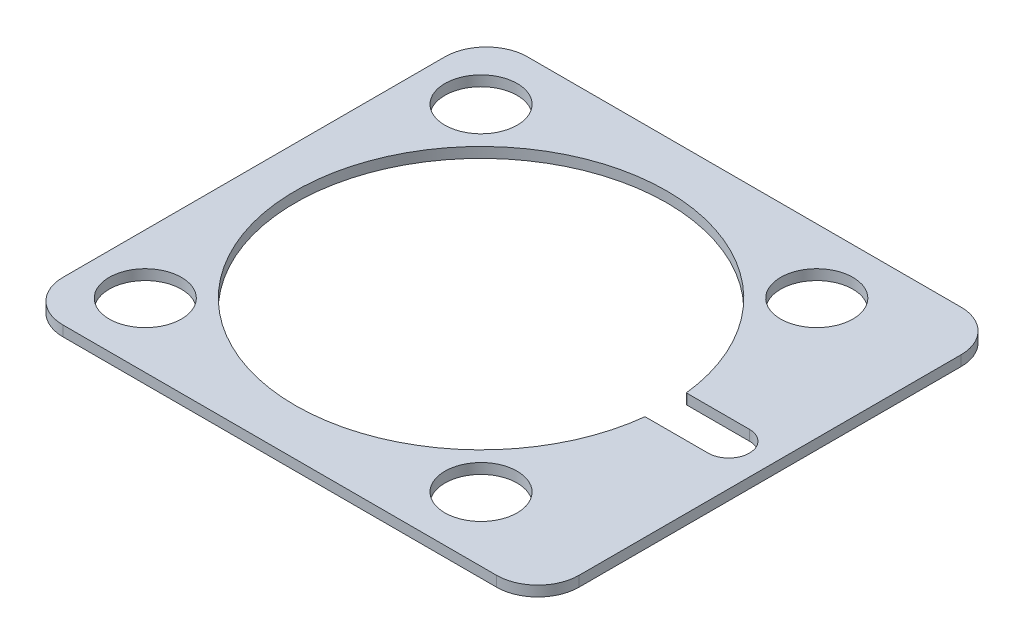
ISO-10303-21;
HEADER;
FILE_DESCRIPTION(('STEP AP214'),'2;1');
FILE_NAME('part.step','',(''),(''),'','','');
FILE_SCHEMA(('AUTOMOTIVE_DESIGN { 1 0 10303 214 1 1 1 1 }'));
ENDSEC;
DATA;
#1=APPLICATION_CONTEXT('core data for automotive mechanical design processes');
#2=APPLICATION_PROTOCOL_DEFINITION('international standard','automotive_design',2000,#1);
#3=PRODUCT_CONTEXT('',#1,'mechanical');
#4=PRODUCT('Part','Part','',(#3));
#5=PRODUCT_RELATED_PRODUCT_CATEGORY('part','',(#4));
#6=PRODUCT_DEFINITION_FORMATION('','',#4);
#7=PRODUCT_DEFINITION_CONTEXT('part definition',#1,'design');
#8=PRODUCT_DEFINITION('design','',#6,#7);
#9=PRODUCT_DEFINITION_SHAPE('','',#8);
#10=(LENGTH_UNIT() NAMED_UNIT(*) SI_UNIT(.MILLI.,.METRE.));
#11=(NAMED_UNIT(*) PLANE_ANGLE_UNIT() SI_UNIT($,.RADIAN.));
#12=(NAMED_UNIT(*) SI_UNIT($,.STERADIAN.) SOLID_ANGLE_UNIT());
#13=UNCERTAINTY_MEASURE_WITH_UNIT(LENGTH_MEASURE(1.E-05),#10,'distance_accuracy_value','');
#14=(GEOMETRIC_REPRESENTATION_CONTEXT(3) GLOBAL_UNCERTAINTY_ASSIGNED_CONTEXT((#13)) GLOBAL_UNIT_ASSIGNED_CONTEXT((#10,
#11,#12)) REPRESENTATION_CONTEXT('',''));
#15=CARTESIAN_POINT('',(0.,0.,0.));
#16=DIRECTION('',(0.,0.,1.));
#17=DIRECTION('',(1.,0.,0.));
#18=AXIS2_PLACEMENT_3D('',#15,#16,#17);
#19=CARTESIAN_POINT('',(-21.,1.,18.5));
#20=DIRECTION('',(0.,-1.,0.));
#21=DIRECTION('',(0.,0.,-1.));
#22=AXIS2_PLACEMENT_3D('',#19,#20,#21);
#23=PLANE('',#22);
#24=CARTESIAN_POINT('',(-19.26345596729,1.,16.2634559672907));
#25=DIRECTION('',(0.,1.,0.));
#26=DIRECTION('',(0.,0.,1.));
#27=AXIS2_PLACEMENT_3D('',#24,#25,#26);
#28=CIRCLE('',#27,3.50000000000021);
#29=CARTESIAN_POINT('',(-19.26345596729,1.,19.7634559672909));
#30=VERTEX_POINT('',#29);
#31=EDGE_CURVE('E210',#30,#30,#28,.T.);
#32=ORIENTED_EDGE('',*,*,#31,.F.);
#33=EDGE_LOOP('',(#32));
#34=FACE_BOUND('',#33,.T.);
#35=CARTESIAN_POINT('',(13.263455967291,1.,16.2634559672902));
#36=DIRECTION('',(0.,1.,0.));
#37=DIRECTION('',(0.,0.,1.));
#38=AXIS2_PLACEMENT_3D('',#35,#36,#37);
#39=CIRCLE('',#38,3.5);
#40=CARTESIAN_POINT('',(13.263455967291,1.,19.7634559672902));
#41=VERTEX_POINT('',#40);
#42=EDGE_CURVE('E218',#41,#41,#39,.T.);
#43=ORIENTED_EDGE('',*,*,#42,.F.);
#44=EDGE_LOOP('',(#43));
#45=FACE_BOUND('',#44,.T.);
#46=CARTESIAN_POINT('',(13.2634559672905,1.,-16.2634559672911));
#47=DIRECTION('',(0.,1.,0.));
#48=DIRECTION('',(0.,0.,1.));
#49=AXIS2_PLACEMENT_3D('',#46,#47,#48);
#50=CIRCLE('',#49,3.50000000000007);
#51=CARTESIAN_POINT('',(13.2634559672905,1.,-12.7634559672911));
#52=VERTEX_POINT('',#51);
#53=EDGE_CURVE('E226',#52,#52,#50,.T.);
#54=ORIENTED_EDGE('',*,*,#53,.F.);
#55=EDGE_LOOP('',(#54));
#56=FACE_BOUND('',#55,.T.);
#57=CARTESIAN_POINT('',(-19.2634559672907,1.,-16.2634559672905));
#58=DIRECTION('',(0.,1.,0.));
#59=DIRECTION('',(0.,0.,1.));
#60=AXIS2_PLACEMENT_3D('',#57,#58,#59);
#61=CIRCLE('',#60,3.5);
#62=CARTESIAN_POINT('',(-19.2634559672907,1.,-12.7634559672905));
#63=VERTEX_POINT('',#62);
#64=EDGE_CURVE('E234',#63,#63,#61,.T.);
#65=ORIENTED_EDGE('',*,*,#64,.F.);
#66=EDGE_LOOP('',(#65));
#67=FACE_BOUND('',#66,.T.);
#68=CARTESIAN_POINT('',(-21.,1.,18.5));
#69=DIRECTION('',(0.,1.,0.));
#70=DIRECTION('',(0.,0.,-1.));
#71=AXIS2_PLACEMENT_3D('',#68,#69,#70);
#72=CIRCLE('',#71,4.);
#73=CARTESIAN_POINT('',(-25.,1.,18.5));
#74=VERTEX_POINT('',#73);
#75=CARTESIAN_POINT('',(-21.,1.,22.5));
#76=VERTEX_POINT('',#75);
#77=EDGE_CURVE('E242',#74,#76,#72,.T.);
#78=ORIENTED_EDGE('',*,*,#77,.T.);
#79=DIRECTION('',(1.,0.,0.));
#80=VECTOR('',#79,1.);
#81=CARTESIAN_POINT('',(-21.,1.,22.5));
#82=LINE('',#81,#80);
#83=CARTESIAN_POINT('',(21.,1.,22.5));
#84=VERTEX_POINT('',#83);
#85=EDGE_CURVE('E246',#76,#84,#82,.T.);
#86=ORIENTED_EDGE('',*,*,#85,.T.);
#87=CARTESIAN_POINT('',(21.,1.,18.5));
#88=DIRECTION('',(0.,1.,0.));
#89=DIRECTION('',(0.,0.,1.));
#90=AXIS2_PLACEMENT_3D('',#87,#88,#89);
#91=CIRCLE('',#90,4.);
#92=CARTESIAN_POINT('',(25.,1.,18.5));
#93=VERTEX_POINT('',#92);
#94=EDGE_CURVE('E250',#84,#93,#91,.T.);
#95=ORIENTED_EDGE('',*,*,#94,.T.);
#96=DIRECTION('',(0.,0.,-1.));
#97=VECTOR('',#96,1.);
#98=CARTESIAN_POINT('',(25.,1.,18.5));
#99=LINE('',#98,#97);
#100=CARTESIAN_POINT('',(25.,1.,-18.5));
#101=VERTEX_POINT('',#100);
#102=EDGE_CURVE('E253',#93,#101,#99,.T.);
#103=ORIENTED_EDGE('',*,*,#102,.T.);
#104=CARTESIAN_POINT('',(21.,1.,-18.5));
#105=DIRECTION('',(0.,1.,0.));
#106=DIRECTION('',(0.,0.,-1.));
#107=AXIS2_PLACEMENT_3D('',#104,#105,#106);
#108=CIRCLE('',#107,4.);
#109=CARTESIAN_POINT('',(21.,1.,-22.5));
#110=VERTEX_POINT('',#109);
#111=EDGE_CURVE('E256',#101,#110,#108,.T.);
#112=ORIENTED_EDGE('',*,*,#111,.T.);
#113=DIRECTION('',(-1.,0.,0.));
#114=VECTOR('',#113,1.);
#115=CARTESIAN_POINT('',(-21.,1.,-22.5));
#116=LINE('',#115,#114);
#117=CARTESIAN_POINT('',(-21.,1.,-22.5));
#118=VERTEX_POINT('',#117);
#119=EDGE_CURVE('E259',#110,#118,#116,.T.);
#120=ORIENTED_EDGE('',*,*,#119,.T.);
#121=CARTESIAN_POINT('',(-21.,1.,-18.5));
#122=DIRECTION('',(0.,1.,0.));
#123=DIRECTION('',(0.,0.,-1.));
#124=AXIS2_PLACEMENT_3D('',#121,#122,#123);
#125=CIRCLE('',#124,4.);
#126=CARTESIAN_POINT('',(-25.,1.,-18.5));
#127=VERTEX_POINT('',#126);
#128=EDGE_CURVE('E262',#118,#127,#125,.T.);
#129=ORIENTED_EDGE('',*,*,#128,.T.);
#130=DIRECTION('',(0.,0.,1.));
#131=VECTOR('',#130,1.);
#132=CARTESIAN_POINT('',(-25.,1.,18.5));
#133=LINE('',#132,#131);
#134=EDGE_CURVE('E265',#127,#74,#133,.T.);
#135=ORIENTED_EDGE('',*,*,#134,.T.);
#136=EDGE_LOOP('',(#78,#86,#95,#103,#112,#120,#129,#135));
#137=FACE_BOUND('',#136,.T.);
#138=CARTESIAN_POINT('',(15.,1.,0.));
#139=DIRECTION('',(0.,1.,0.));
#140=DIRECTION('',(0.,0.,1.));
#141=AXIS2_PLACEMENT_3D('',#138,#139,#140);
#142=CIRCLE('',#141,2.);
#143=CARTESIAN_POINT('',(15.,1.,-2.));
#144=VERTEX_POINT('',#143);
#145=CARTESIAN_POINT('',(14.8888888888889,1.,-1.99691119506793));
#146=VERTEX_POINT('',#145);
#147=EDGE_CURVE('E141',#144,#146,#142,.T.);
#148=ORIENTED_EDGE('',*,*,#147,.F.);
#149=DIRECTION('',(-1.,0.,0.));
#150=VECTOR('',#149,1.);
#151=CARTESIAN_POINT('',(15.,1.,-2.));
#152=LINE('',#151,#150);
#153=CARTESIAN_POINT('',(21.,1.,-2.));
#154=VERTEX_POINT('',#153);
#155=EDGE_CURVE('E176',#154,#144,#152,.T.);
#156=ORIENTED_EDGE('',*,*,#155,.F.);
#157=CARTESIAN_POINT('',(21.,1.,0.));
#158=DIRECTION('',(0.,1.,0.));
#159=DIRECTION('',(0.,0.,1.));
#160=AXIS2_PLACEMENT_3D('',#157,#158,#159);
#161=CIRCLE('',#160,2.);
#162=CARTESIAN_POINT('',(21.,1.,2.));
#163=VERTEX_POINT('',#162);
#164=EDGE_CURVE('E173',#163,#154,#161,.T.);
#165=ORIENTED_EDGE('',*,*,#164,.F.);
#166=DIRECTION('',(1.,0.,0.));
#167=VECTOR('',#166,1.);
#168=CARTESIAN_POINT('',(15.,1.,2.));
#169=LINE('',#168,#167);
#170=CARTESIAN_POINT('',(15.,1.,2.));
#171=VERTEX_POINT('',#170);
#172=EDGE_CURVE('E168',#171,#163,#169,.T.);
#173=ORIENTED_EDGE('',*,*,#172,.F.);
#174=CARTESIAN_POINT('',(15.,1.,0.));
#175=DIRECTION('',(0.,1.,0.));
#176=DIRECTION('',(0.,0.,1.));
#177=AXIS2_PLACEMENT_3D('',#174,#175,#176);
#178=CIRCLE('',#177,2.);
#179=CARTESIAN_POINT('',(14.8888888888889,1.,1.99691119506793));
#180=VERTEX_POINT('',#179);
#181=EDGE_CURVE('E164',#180,#171,#178,.T.);
#182=ORIENTED_EDGE('',*,*,#181,.F.);
#183=CARTESIAN_POINT('',(-3.,1.,0.));
#184=DIRECTION('',(0.,1.,0.));
#185=DIRECTION('',(0.,0.,1.));
#186=AXIS2_PLACEMENT_3D('',#183,#184,#185);
#187=CIRCLE('',#186,18.);
#188=EDGE_CURVE('E150',#146,#180,#187,.T.);
#189=ORIENTED_EDGE('',*,*,#188,.F.);
#190=EDGE_LOOP('',(#148,#156,#165,#173,#182,#189));
#191=FACE_BOUND('',#190,.T.);
#192=ADVANCED_FACE('F39',(#34,#45,#56,#67,#137,#191),#23,.F.);
#193=CARTESIAN_POINT('',(-21.,0.,18.5));
#194=DIRECTION('',(0.,-1.,0.));
#195=DIRECTION('',(0.,0.,-1.));
#196=AXIS2_PLACEMENT_3D('',#193,#194,#195);
#197=PLANE('',#196);
#198=CARTESIAN_POINT('',(13.263455967291,0.,16.2634559672902));
#199=DIRECTION('',(0.,1.,0.));
#200=DIRECTION('',(0.,0.,1.));
#201=AXIS2_PLACEMENT_3D('',#198,#199,#200);
#202=CIRCLE('',#201,3.5);
#203=CARTESIAN_POINT('',(13.263455967291,0.,19.7634559672902));
#204=VERTEX_POINT('',#203);
#205=EDGE_CURVE('E214',#204,#204,#202,.T.);
#206=ORIENTED_EDGE('',*,*,#205,.T.);
#207=EDGE_LOOP('',(#206));
#208=FACE_BOUND('',#207,.T.);
#209=CARTESIAN_POINT('',(-19.2634559672907,0.,-16.2634559672905));
#210=DIRECTION('',(0.,1.,0.));
#211=DIRECTION('',(0.,0.,1.));
#212=AXIS2_PLACEMENT_3D('',#209,#210,#211);
#213=CIRCLE('',#212,3.5);
#214=CARTESIAN_POINT('',(-19.2634559672907,0.,-12.7634559672905));
#215=VERTEX_POINT('',#214);
#216=EDGE_CURVE('E230',#215,#215,#213,.T.);
#217=ORIENTED_EDGE('',*,*,#216,.T.);
#218=EDGE_LOOP('',(#217));
#219=FACE_BOUND('',#218,.T.);
#220=CARTESIAN_POINT('',(-21.,0.,18.5));
#221=DIRECTION('',(0.,1.,0.));
#222=DIRECTION('',(0.,0.,-1.));
#223=AXIS2_PLACEMENT_3D('',#220,#221,#222);
#224=CIRCLE('',#223,4.);
#225=CARTESIAN_POINT('',(-25.,0.,18.5));
#226=VERTEX_POINT('',#225);
#227=CARTESIAN_POINT('',(-21.,0.,22.5));
#228=VERTEX_POINT('',#227);
#229=EDGE_CURVE('E238',#226,#228,#224,.T.);
#230=ORIENTED_EDGE('',*,*,#229,.F.);
#231=DIRECTION('',(0.,0.,1.));
#232=VECTOR('',#231,1.);
#233=CARTESIAN_POINT('',(-25.,0.,18.5));
#234=LINE('',#233,#232);
#235=CARTESIAN_POINT('',(-25.,0.,-18.5));
#236=VERTEX_POINT('',#235);
#237=EDGE_CURVE('E247',#236,#226,#234,.T.);
#238=ORIENTED_EDGE('',*,*,#237,.F.);
#239=CARTESIAN_POINT('',(-21.,0.,-18.5));
#240=DIRECTION('',(0.,1.,0.));
#241=DIRECTION('',(0.,0.,-1.));
#242=AXIS2_PLACEMENT_3D('',#239,#240,#241);
#243=CIRCLE('',#242,4.);
#244=CARTESIAN_POINT('',(-21.,0.,-22.5));
#245=VERTEX_POINT('',#244);
#246=EDGE_CURVE('E287',#245,#236,#243,.T.);
#247=ORIENTED_EDGE('',*,*,#246,.F.);
#248=DIRECTION('',(-1.,0.,0.));
#249=VECTOR('',#248,1.);
#250=CARTESIAN_POINT('',(-21.,0.,-22.5));
#251=LINE('',#250,#249);
#252=CARTESIAN_POINT('',(21.,0.,-22.5));
#253=VERTEX_POINT('',#252);
#254=EDGE_CURVE('E284',#253,#245,#251,.T.);
#255=ORIENTED_EDGE('',*,*,#254,.F.);
#256=CARTESIAN_POINT('',(21.,0.,-18.5));
#257=DIRECTION('',(0.,1.,0.));
#258=DIRECTION('',(0.,0.,-1.));
#259=AXIS2_PLACEMENT_3D('',#256,#257,#258);
#260=CIRCLE('',#259,4.);
#261=CARTESIAN_POINT('',(25.,0.,-18.5));
#262=VERTEX_POINT('',#261);
#263=EDGE_CURVE('E281',#262,#253,#260,.T.);
#264=ORIENTED_EDGE('',*,*,#263,.F.);
#265=DIRECTION('',(0.,0.,-1.));
#266=VECTOR('',#265,1.);
#267=CARTESIAN_POINT('',(25.,0.,18.5));
#268=LINE('',#267,#266);
#269=CARTESIAN_POINT('',(25.,0.,18.5));
#270=VERTEX_POINT('',#269);
#271=EDGE_CURVE('E278',#270,#262,#268,.T.);
#272=ORIENTED_EDGE('',*,*,#271,.F.);
#273=CARTESIAN_POINT('',(21.,0.,18.5));
#274=DIRECTION('',(0.,1.,0.));
#275=DIRECTION('',(0.,0.,1.));
#276=AXIS2_PLACEMENT_3D('',#273,#274,#275);
#277=CIRCLE('',#276,4.);
#278=CARTESIAN_POINT('',(21.,0.,22.5));
#279=VERTEX_POINT('',#278);
#280=EDGE_CURVE('E275',#279,#270,#277,.T.);
#281=ORIENTED_EDGE('',*,*,#280,.F.);
#282=DIRECTION('',(1.,0.,0.));
#283=VECTOR('',#282,1.);
#284=CARTESIAN_POINT('',(-21.,0.,22.5));
#285=LINE('',#284,#283);
#286=EDGE_CURVE('E272',#228,#279,#285,.T.);
#287=ORIENTED_EDGE('',*,*,#286,.F.);
#288=EDGE_LOOP('',(#230,#238,#247,#255,#264,#272,#281,#287));
#289=FACE_BOUND('',#288,.T.);
#290=CARTESIAN_POINT('',(13.2634559672905,0.,-16.2634559672911));
#291=DIRECTION('',(0.,1.,0.));
#292=DIRECTION('',(0.,0.,1.));
#293=AXIS2_PLACEMENT_3D('',#290,#291,#292);
#294=CIRCLE('',#293,3.50000000000007);
#295=CARTESIAN_POINT('',(13.2634559672905,0.,-12.7634559672911));
#296=VERTEX_POINT('',#295);
#297=EDGE_CURVE('E222',#296,#296,#294,.T.);
#298=ORIENTED_EDGE('',*,*,#297,.T.);
#299=EDGE_LOOP('',(#298));
#300=FACE_BOUND('',#299,.T.);
#301=CARTESIAN_POINT('',(-19.26345596729,0.,16.2634559672907));
#302=DIRECTION('',(0.,1.,0.));
#303=DIRECTION('',(0.,0.,1.));
#304=AXIS2_PLACEMENT_3D('',#301,#302,#303);
#305=CIRCLE('',#304,3.50000000000021);
#306=CARTESIAN_POINT('',(-19.26345596729,0.,19.7634559672909));
#307=VERTEX_POINT('',#306);
#308=EDGE_CURVE('E159',#307,#307,#305,.T.);
#309=ORIENTED_EDGE('',*,*,#308,.T.);
#310=EDGE_LOOP('',(#309));
#311=FACE_BOUND('',#310,.T.);
#312=DIRECTION('',(-1.,0.,0.));
#313=VECTOR('',#312,1.);
#314=CARTESIAN_POINT('',(15.,0.,-2.));
#315=LINE('',#314,#313);
#316=CARTESIAN_POINT('',(21.,0.,-2.));
#317=VERTEX_POINT('',#316);
#318=CARTESIAN_POINT('',(15.,0.,-2.));
#319=VERTEX_POINT('',#318);
#320=EDGE_CURVE('E151',#317,#319,#315,.T.);
#321=ORIENTED_EDGE('',*,*,#320,.T.);
#322=CARTESIAN_POINT('',(15.,0.,0.));
#323=DIRECTION('',(0.,1.,0.));
#324=DIRECTION('',(0.,0.,1.));
#325=AXIS2_PLACEMENT_3D('',#322,#323,#324);
#326=CIRCLE('',#325,2.);
#327=CARTESIAN_POINT('',(14.8888888888889,0.,-1.99691119506793));
#328=VERTEX_POINT('',#327);
#329=EDGE_CURVE('E63',#319,#328,#326,.T.);
#330=ORIENTED_EDGE('',*,*,#329,.T.);
#331=CARTESIAN_POINT('',(-3.,0.,0.));
#332=DIRECTION('',(0.,1.,0.));
#333=DIRECTION('',(0.,0.,1.));
#334=AXIS2_PLACEMENT_3D('',#331,#332,#333);
#335=CIRCLE('',#334,18.);
#336=CARTESIAN_POINT('',(14.8888888888889,0.,1.99691119506793));
#337=VERTEX_POINT('',#336);
#338=EDGE_CURVE('E157',#328,#337,#335,.T.);
#339=ORIENTED_EDGE('',*,*,#338,.T.);
#340=CARTESIAN_POINT('',(15.,0.,0.));
#341=DIRECTION('',(0.,1.,0.));
#342=DIRECTION('',(0.,0.,1.));
#343=AXIS2_PLACEMENT_3D('',#340,#341,#342);
#344=CIRCLE('',#343,2.);
#345=CARTESIAN_POINT('',(15.,0.,2.));
#346=VERTEX_POINT('',#345);
#347=EDGE_CURVE('E183',#337,#346,#344,.T.);
#348=ORIENTED_EDGE('',*,*,#347,.T.);
#349=DIRECTION('',(1.,0.,0.));
#350=VECTOR('',#349,1.);
#351=CARTESIAN_POINT('',(15.,0.,2.));
#352=LINE('',#351,#350);
#353=CARTESIAN_POINT('',(21.,0.,2.));
#354=VERTEX_POINT('',#353);
#355=EDGE_CURVE('E187',#346,#354,#352,.T.);
#356=ORIENTED_EDGE('',*,*,#355,.T.);
#357=CARTESIAN_POINT('',(21.,0.,0.));
#358=DIRECTION('',(0.,1.,0.));
#359=DIRECTION('',(0.,0.,1.));
#360=AXIS2_PLACEMENT_3D('',#357,#358,#359);
#361=CIRCLE('',#360,2.);
#362=EDGE_CURVE('E191',#354,#317,#361,.T.);
#363=ORIENTED_EDGE('',*,*,#362,.T.);
#364=EDGE_LOOP('',(#321,#330,#339,#348,#356,#363));
#365=FACE_BOUND('',#364,.T.);
#366=ADVANCED_FACE('F326',(#208,#219,#289,#300,#311,#365),#197,.T.);
#367=CARTESIAN_POINT('',(-21.,1.,18.5));
#368=DIRECTION('',(0.,-1.,0.));
#369=DIRECTION('',(0.,0.,-1.));
#370=AXIS2_PLACEMENT_3D('',#367,#368,#369);
#371=CYLINDRICAL_SURFACE('',#370,4.);
#372=ORIENTED_EDGE('',*,*,#229,.T.);
#373=DIRECTION('',(0.,-1.,0.));
#374=VECTOR('',#373,1.);
#375=CARTESIAN_POINT('',(-21.,1.,22.5));
#376=LINE('',#375,#374);
#377=EDGE_CURVE('E11',#76,#228,#376,.T.);
#378=ORIENTED_EDGE('',*,*,#377,.F.);
#379=ORIENTED_EDGE('',*,*,#77,.F.);
#380=DIRECTION('',(0.,-1.,0.));
#381=VECTOR('',#380,1.);
#382=CARTESIAN_POINT('',(-25.,1.,18.5));
#383=LINE('',#382,#381);
#384=EDGE_CURVE('E268',#74,#226,#383,.T.);
#385=ORIENTED_EDGE('',*,*,#384,.T.);
#386=EDGE_LOOP('',(#372,#378,#379,#385));
#387=FACE_BOUND('',#386,.T.);
#388=ADVANCED_FACE('F41',(#387),#371,.T.);
#389=CARTESIAN_POINT('',(-21.,1.,22.5));
#390=DIRECTION('',(0.,0.,-1.));
#391=DIRECTION('',(-1.,0.,0.));
#392=AXIS2_PLACEMENT_3D('',#389,#390,#391);
#393=PLANE('',#392);
#394=ORIENTED_EDGE('',*,*,#286,.T.);
#395=DIRECTION('',(0.,-1.,0.));
#396=VECTOR('',#395,1.);
#397=CARTESIAN_POINT('',(21.,1.,22.5));
#398=LINE('',#397,#396);
#399=EDGE_CURVE('E48',#84,#279,#398,.T.);
#400=ORIENTED_EDGE('',*,*,#399,.F.);
#401=ORIENTED_EDGE('',*,*,#85,.F.);
#402=ORIENTED_EDGE('',*,*,#377,.T.);
#403=EDGE_LOOP('',(#394,#400,#401,#402));
#404=FACE_BOUND('',#403,.T.);
#405=ADVANCED_FACE('F343',(#404),#393,.F.);
#406=CARTESIAN_POINT('',(21.,1.,18.5));
#407=DIRECTION('',(0.,-1.,0.));
#408=DIRECTION('',(0.,0.,-1.));
#409=AXIS2_PLACEMENT_3D('',#406,#407,#408);
#410=CYLINDRICAL_SURFACE('',#409,4.);
#411=ORIENTED_EDGE('',*,*,#280,.T.);
#412=DIRECTION('',(0.,-1.,0.));
#413=VECTOR('',#412,1.);
#414=CARTESIAN_POINT('',(25.,1.,18.5));
#415=LINE('',#414,#413);
#416=EDGE_CURVE('E311',#93,#270,#415,.T.);
#417=ORIENTED_EDGE('',*,*,#416,.F.);
#418=ORIENTED_EDGE('',*,*,#94,.F.);
#419=ORIENTED_EDGE('',*,*,#399,.T.);
#420=EDGE_LOOP('',(#411,#417,#418,#419));
#421=FACE_BOUND('',#420,.T.);
#422=ADVANCED_FACE('F320',(#421),#410,.T.);
#423=CARTESIAN_POINT('',(25.,1.,18.5));
#424=DIRECTION('',(-1.,0.,0.));
#425=DIRECTION('',(0.,0.,1.));
#426=AXIS2_PLACEMENT_3D('',#423,#424,#425);
#427=PLANE('',#426);
#428=ORIENTED_EDGE('',*,*,#271,.T.);
#429=DIRECTION('',(0.,-1.,0.));
#430=VECTOR('',#429,1.);
#431=CARTESIAN_POINT('',(25.,1.,-18.5));
#432=LINE('',#431,#430);
#433=EDGE_CURVE('E307',#101,#262,#432,.T.);
#434=ORIENTED_EDGE('',*,*,#433,.F.);
#435=ORIENTED_EDGE('',*,*,#102,.F.);
#436=ORIENTED_EDGE('',*,*,#416,.T.);
#437=EDGE_LOOP('',(#428,#434,#435,#436));
#438=FACE_BOUND('',#437,.T.);
#439=ADVANCED_FACE('F332',(#438),#427,.F.);
#440=CARTESIAN_POINT('',(21.,1.,-18.5));
#441=DIRECTION('',(0.,-1.,0.));
#442=DIRECTION('',(0.,0.,-1.));
#443=AXIS2_PLACEMENT_3D('',#440,#441,#442);
#444=CYLINDRICAL_SURFACE('',#443,4.);
#445=ORIENTED_EDGE('',*,*,#263,.T.);
#446=DIRECTION('',(0.,-1.,0.));
#447=VECTOR('',#446,1.);
#448=CARTESIAN_POINT('',(21.,1.,-22.5));
#449=LINE('',#448,#447);
#450=EDGE_CURVE('E303',#110,#253,#449,.T.);
#451=ORIENTED_EDGE('',*,*,#450,.F.);
#452=ORIENTED_EDGE('',*,*,#111,.F.);
#453=ORIENTED_EDGE('',*,*,#433,.T.);
#454=EDGE_LOOP('',(#445,#451,#452,#453));
#455=FACE_BOUND('',#454,.T.);
#456=ADVANCED_FACE('F336',(#455),#444,.T.);
#457=CARTESIAN_POINT('',(-21.,1.,-22.5));
#458=DIRECTION('',(0.,0.,1.));
#459=DIRECTION('',(1.,0.,0.));
#460=AXIS2_PLACEMENT_3D('',#457,#458,#459);
#461=PLANE('',#460);
#462=ORIENTED_EDGE('',*,*,#254,.T.);
#463=DIRECTION('',(0.,-1.,0.));
#464=VECTOR('',#463,1.);
#465=CARTESIAN_POINT('',(-21.,1.,-22.5));
#466=LINE('',#465,#464);
#467=EDGE_CURVE('E299',#118,#245,#466,.T.);
#468=ORIENTED_EDGE('',*,*,#467,.F.);
#469=ORIENTED_EDGE('',*,*,#119,.F.);
#470=ORIENTED_EDGE('',*,*,#450,.T.);
#471=EDGE_LOOP('',(#462,#468,#469,#470));
#472=FACE_BOUND('',#471,.T.);
#473=ADVANCED_FACE('F356',(#472),#461,.F.);
#474=CARTESIAN_POINT('',(-21.,1.,-18.5));
#475=DIRECTION('',(0.,-1.,0.));
#476=DIRECTION('',(0.,0.,-1.));
#477=AXIS2_PLACEMENT_3D('',#474,#475,#476);
#478=CYLINDRICAL_SURFACE('',#477,4.);
#479=ORIENTED_EDGE('',*,*,#246,.T.);
#480=DIRECTION('',(0.,-1.,0.));
#481=VECTOR('',#480,1.);
#482=CARTESIAN_POINT('',(-25.,1.,-18.5));
#483=LINE('',#482,#481);
#484=EDGE_CURVE('E295',#127,#236,#483,.T.);
#485=ORIENTED_EDGE('',*,*,#484,.F.);
#486=ORIENTED_EDGE('',*,*,#128,.F.);
#487=ORIENTED_EDGE('',*,*,#467,.T.);
#488=EDGE_LOOP('',(#479,#485,#486,#487));
#489=FACE_BOUND('',#488,.T.);
#490=ADVANCED_FACE('F354',(#489),#478,.T.);
#491=CARTESIAN_POINT('',(-25.,1.,18.5));
#492=DIRECTION('',(1.,0.,0.));
#493=DIRECTION('',(0.,0.,-1.));
#494=AXIS2_PLACEMENT_3D('',#491,#492,#493);
#495=PLANE('',#494);
#496=ORIENTED_EDGE('',*,*,#237,.T.);
#497=ORIENTED_EDGE('',*,*,#384,.F.);
#498=ORIENTED_EDGE('',*,*,#134,.F.);
#499=ORIENTED_EDGE('',*,*,#484,.T.);
#500=EDGE_LOOP('',(#496,#497,#498,#499));
#501=FACE_BOUND('',#500,.T.);
#502=ADVANCED_FACE('F349',(#501),#495,.F.);
#503=CARTESIAN_POINT('',(-19.2634559672907,1.,-16.2634559672905));
#504=DIRECTION('',(0.,-1.,0.));
#505=DIRECTION('',(0.,0.,-1.));
#506=AXIS2_PLACEMENT_3D('',#503,#504,#505);
#507=CYLINDRICAL_SURFACE('',#506,3.5);
#508=ORIENTED_EDGE('',*,*,#64,.T.);
#509=EDGE_LOOP('',(#508));
#510=FACE_BOUND('',#509,.T.);
#511=ORIENTED_EDGE('',*,*,#216,.F.);
#512=EDGE_LOOP('',(#511));
#513=FACE_BOUND('',#512,.T.);
#514=ADVANCED_FACE('F376',(#510,#513),#507,.F.);
#515=CARTESIAN_POINT('',(13.2634559672905,1.,-16.2634559672911));
#516=DIRECTION('',(0.,-1.,0.));
#517=DIRECTION('',(0.,0.,-1.));
#518=AXIS2_PLACEMENT_3D('',#515,#516,#517);
#519=CYLINDRICAL_SURFACE('',#518,3.50000000000007);
#520=ORIENTED_EDGE('',*,*,#53,.T.);
#521=EDGE_LOOP('',(#520));
#522=FACE_BOUND('',#521,.T.);
#523=ORIENTED_EDGE('',*,*,#297,.F.);
#524=EDGE_LOOP('',(#523));
#525=FACE_BOUND('',#524,.T.);
#526=ADVANCED_FACE('F383',(#522,#525),#519,.F.);
#527=CARTESIAN_POINT('',(13.263455967291,1.,16.2634559672902));
#528=DIRECTION('',(0.,-1.,0.));
#529=DIRECTION('',(0.,0.,-1.));
#530=AXIS2_PLACEMENT_3D('',#527,#528,#529);
#531=CYLINDRICAL_SURFACE('',#530,3.5);
#532=ORIENTED_EDGE('',*,*,#42,.T.);
#533=EDGE_LOOP('',(#532));
#534=FACE_BOUND('',#533,.T.);
#535=ORIENTED_EDGE('',*,*,#205,.F.);
#536=EDGE_LOOP('',(#535));
#537=FACE_BOUND('',#536,.T.);
#538=ADVANCED_FACE('F388',(#534,#537),#531,.F.);
#539=CARTESIAN_POINT('',(-19.26345596729,1.,16.2634559672907));
#540=DIRECTION('',(0.,-1.,0.));
#541=DIRECTION('',(0.,0.,-1.));
#542=AXIS2_PLACEMENT_3D('',#539,#540,#541);
#543=CYLINDRICAL_SURFACE('',#542,3.50000000000021);
#544=ORIENTED_EDGE('',*,*,#31,.T.);
#545=EDGE_LOOP('',(#544));
#546=FACE_BOUND('',#545,.T.);
#547=ORIENTED_EDGE('',*,*,#308,.F.);
#548=EDGE_LOOP('',(#547));
#549=FACE_BOUND('',#548,.T.);
#550=ADVANCED_FACE('F398',(#546,#549),#543,.F.);
#551=CARTESIAN_POINT('',(15.,1.,0.));
#552=DIRECTION('',(0.,-1.,0.));
#553=DIRECTION('',(0.,0.,-1.));
#554=AXIS2_PLACEMENT_3D('',#551,#552,#553);
#555=CYLINDRICAL_SURFACE('',#554,2.);
#556=ORIENTED_EDGE('',*,*,#329,.F.);
#557=DIRECTION('',(0.,-1.,0.));
#558=VECTOR('',#557,1.);
#559=CARTESIAN_POINT('',(15.,1.,-2.));
#560=LINE('',#559,#558);
#561=EDGE_CURVE('E145',#144,#319,#560,.T.);
#562=ORIENTED_EDGE('',*,*,#561,.F.);
#563=ORIENTED_EDGE('',*,*,#147,.T.);
#564=DIRECTION('',(0.,-1.,0.));
#565=VECTOR('',#564,1.);
#566=CARTESIAN_POINT('',(14.8888888888889,1.,-1.99691119506793));
#567=LINE('',#566,#565);
#568=EDGE_CURVE('E144',#146,#328,#567,.T.);
#569=ORIENTED_EDGE('',*,*,#568,.T.);
#570=EDGE_LOOP('',(#556,#562,#563,#569));
#571=FACE_BOUND('',#570,.T.);
#572=ADVANCED_FACE('F143',(#571),#555,.F.);
#573=CARTESIAN_POINT('',(-3.,1.,0.));
#574=DIRECTION('',(0.,-1.,0.));
#575=DIRECTION('',(0.,0.,-1.));
#576=AXIS2_PLACEMENT_3D('',#573,#574,#575);
#577=CYLINDRICAL_SURFACE('',#576,18.);
#578=ORIENTED_EDGE('',*,*,#338,.F.);
#579=ORIENTED_EDGE('',*,*,#568,.F.);
#580=ORIENTED_EDGE('',*,*,#188,.T.);
#581=DIRECTION('',(0.,-1.,0.));
#582=VECTOR('',#581,1.);
#583=CARTESIAN_POINT('',(14.8888888888889,1.,1.99691119506793));
#584=LINE('',#583,#582);
#585=EDGE_CURVE('E160',#180,#337,#584,.T.);
#586=ORIENTED_EDGE('',*,*,#585,.T.);
#587=EDGE_LOOP('',(#578,#579,#580,#586));
#588=FACE_BOUND('',#587,.T.);
#589=ADVANCED_FACE('F154',(#588),#577,.F.);
#590=CARTESIAN_POINT('',(15.,1.,0.));
#591=DIRECTION('',(0.,-1.,0.));
#592=DIRECTION('',(0.,0.,-1.));
#593=AXIS2_PLACEMENT_3D('',#590,#591,#592);
#594=CYLINDRICAL_SURFACE('',#593,2.);
#595=ORIENTED_EDGE('',*,*,#347,.F.);
#596=ORIENTED_EDGE('',*,*,#585,.F.);
#597=ORIENTED_EDGE('',*,*,#181,.T.);
#598=DIRECTION('',(0.,-1.,0.));
#599=VECTOR('',#598,1.);
#600=CARTESIAN_POINT('',(15.,1.,2.));
#601=LINE('',#600,#599);
#602=EDGE_CURVE('E205',#171,#346,#601,.T.);
#603=ORIENTED_EDGE('',*,*,#602,.T.);
#604=EDGE_LOOP('',(#595,#596,#597,#603));
#605=FACE_BOUND('',#604,.T.);
#606=ADVANCED_FACE('F410',(#605),#594,.F.);
#607=CARTESIAN_POINT('',(15.,1.,2.));
#608=DIRECTION('',(0.,0.,-1.));
#609=DIRECTION('',(-1.,0.,0.));
#610=AXIS2_PLACEMENT_3D('',#607,#608,#609);
#611=PLANE('',#610);
#612=ORIENTED_EDGE('',*,*,#355,.F.);
#613=ORIENTED_EDGE('',*,*,#602,.F.);
#614=ORIENTED_EDGE('',*,*,#172,.T.);
#615=DIRECTION('',(0.,-1.,0.));
#616=VECTOR('',#615,1.);
#617=CARTESIAN_POINT('',(21.,1.,2.));
#618=LINE('',#617,#616);
#619=EDGE_CURVE('E202',#163,#354,#618,.T.);
#620=ORIENTED_EDGE('',*,*,#619,.T.);
#621=EDGE_LOOP('',(#612,#613,#614,#620));
#622=FACE_BOUND('',#621,.T.);
#623=ADVANCED_FACE('F413',(#622),#611,.T.);
#624=CARTESIAN_POINT('',(21.,1.,0.));
#625=DIRECTION('',(0.,-1.,0.));
#626=DIRECTION('',(0.,0.,-1.));
#627=AXIS2_PLACEMENT_3D('',#624,#625,#626);
#628=CYLINDRICAL_SURFACE('',#627,2.);
#629=ORIENTED_EDGE('',*,*,#362,.F.);
#630=ORIENTED_EDGE('',*,*,#619,.F.);
#631=ORIENTED_EDGE('',*,*,#164,.T.);
#632=DIRECTION('',(0.,-1.,0.));
#633=VECTOR('',#632,1.);
#634=CARTESIAN_POINT('',(21.,1.,-2.));
#635=LINE('',#634,#633);
#636=EDGE_CURVE('E55',#154,#317,#635,.T.);
#637=ORIENTED_EDGE('',*,*,#636,.T.);
#638=EDGE_LOOP('',(#629,#630,#631,#637));
#639=FACE_BOUND('',#638,.T.);
#640=ADVANCED_FACE('F417',(#639),#628,.F.);
#641=CARTESIAN_POINT('',(15.,1.,-2.));
#642=DIRECTION('',(0.,0.,1.));
#643=DIRECTION('',(1.,0.,0.));
#644=AXIS2_PLACEMENT_3D('',#641,#642,#643);
#645=PLANE('',#644);
#646=ORIENTED_EDGE('',*,*,#320,.F.);
#647=ORIENTED_EDGE('',*,*,#636,.F.);
#648=ORIENTED_EDGE('',*,*,#155,.T.);
#649=ORIENTED_EDGE('',*,*,#561,.T.);
#650=EDGE_LOOP('',(#646,#647,#648,#649));
#651=FACE_BOUND('',#650,.T.);
#652=ADVANCED_FACE('F421',(#651),#645,.T.);
#653=CLOSED_SHELL('',(#192,#366,#388,#405,#422,#439,#456,#473,#490,#502,#514,#526,#538,#550,
#572,#589,#606,#623,#640,#652));
#654=MANIFOLD_SOLID_BREP('B2',#653);
#655=ADVANCED_BREP_SHAPE_REPRESENTATION('',(#18,#654),#14);
#656=SHAPE_DEFINITION_REPRESENTATION(#9,#655);
ENDSEC;
END-ISO-10303-21;
